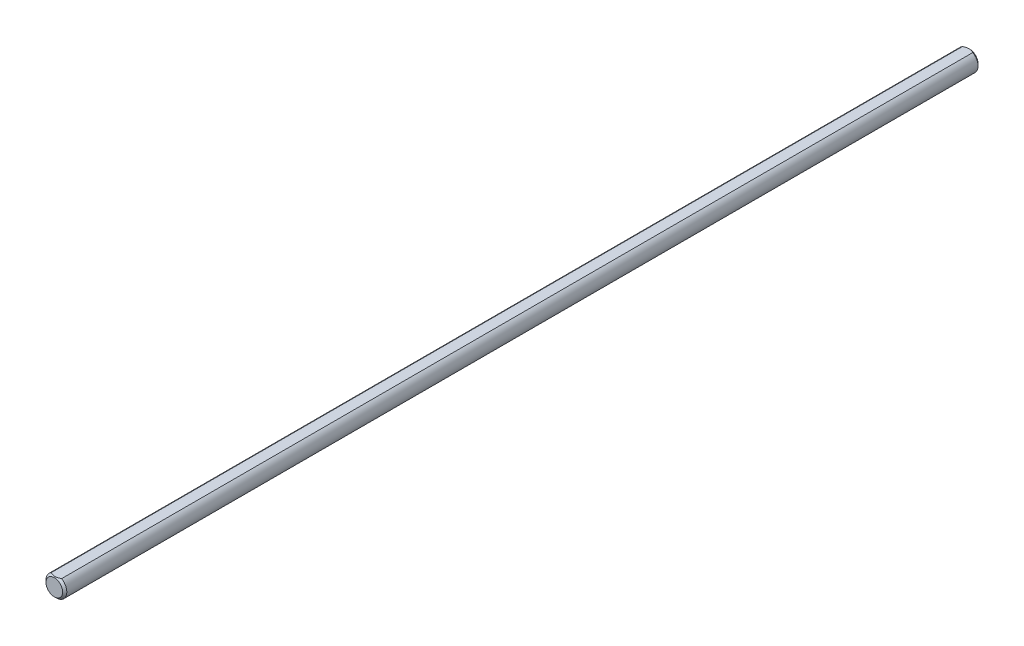
ISO-10303-21;
HEADER;
FILE_DESCRIPTION(('STEP AP214'),'2;1');
FILE_NAME('part.step','',(''),(''),'','','');
FILE_SCHEMA(('AUTOMOTIVE_DESIGN { 1 0 10303 214 1 1 1 1 }'));
ENDSEC;
DATA;
#1=APPLICATION_CONTEXT('core data for automotive mechanical design processes');
#2=APPLICATION_PROTOCOL_DEFINITION('international standard','automotive_design',2000,#1);
#3=PRODUCT_CONTEXT('',#1,'mechanical');
#4=PRODUCT('Part','Part','',(#3));
#5=PRODUCT_RELATED_PRODUCT_CATEGORY('part','',(#4));
#6=PRODUCT_DEFINITION_FORMATION('','',#4);
#7=PRODUCT_DEFINITION_CONTEXT('part definition',#1,'design');
#8=PRODUCT_DEFINITION('design','',#6,#7);
#9=PRODUCT_DEFINITION_SHAPE('','',#8);
#10=(LENGTH_UNIT() NAMED_UNIT(*) SI_UNIT(.MILLI.,.METRE.));
#11=(NAMED_UNIT(*) PLANE_ANGLE_UNIT() SI_UNIT($,.RADIAN.));
#12=(NAMED_UNIT(*) SI_UNIT($,.STERADIAN.) SOLID_ANGLE_UNIT());
#13=UNCERTAINTY_MEASURE_WITH_UNIT(LENGTH_MEASURE(1.E-05),#10,'distance_accuracy_value','');
#14=(GEOMETRIC_REPRESENTATION_CONTEXT(3) GLOBAL_UNCERTAINTY_ASSIGNED_CONTEXT((#13)) GLOBAL_UNIT_ASSIGNED_CONTEXT((#10,
#11,#12)) REPRESENTATION_CONTEXT('',''));
#15=CARTESIAN_POINT('',(0.,0.,0.));
#16=DIRECTION('',(0.,0.,1.));
#17=DIRECTION('',(1.,0.,0.));
#18=AXIS2_PLACEMENT_3D('',#15,#16,#17);
#19=CARTESIAN_POINT('',(0.,0.,139.7));
#20=DIRECTION('',(0.,0.,-1.));
#21=DIRECTION('',(-1.,0.,0.));
#22=AXIS2_PLACEMENT_3D('',#19,#20,#21);
#23=CYLINDRICAL_SURFACE('',#22,3.175);
#24=CARTESIAN_POINT('',(0.,0.,139.065));
#25=DIRECTION('',(0.,0.,1.));
#26=DIRECTION('',(1.,0.,0.));
#27=AXIS2_PLACEMENT_3D('',#24,#25,#26);
#28=CIRCLE('',#27,3.175);
#29=CARTESIAN_POINT('',(1.5875,2.74963065701559,139.065));
#30=VERTEX_POINT('',#29);
#31=CARTESIAN_POINT('',(-1.5875,2.74963065701559,139.065));
#32=VERTEX_POINT('',#31);
#33=EDGE_CURVE('E73',#30,#32,#28,.F.);
#34=ORIENTED_EDGE('',*,*,#33,.T.);
#35=DIRECTION('',(0.,0.,1.));
#36=VECTOR('',#35,1.);
#37=CARTESIAN_POINT('',(-1.5875,2.74963065701559,-139.7));
#38=LINE('',#37,#36);
#39=CARTESIAN_POINT('',(-1.5875,2.74963065701559,-139.065));
#40=VERTEX_POINT('',#39);
#41=EDGE_CURVE('E51',#40,#32,#38,.T.);
#42=ORIENTED_EDGE('',*,*,#41,.F.);
#43=CARTESIAN_POINT('',(0.,0.,-139.065));
#44=DIRECTION('',(0.,0.,1.));
#45=DIRECTION('',(1.,0.,0.));
#46=AXIS2_PLACEMENT_3D('',#43,#44,#45);
#47=CIRCLE('',#46,3.175);
#48=CARTESIAN_POINT('',(1.5875,2.74963065701559,-139.065));
#49=VERTEX_POINT('',#48);
#50=EDGE_CURVE('E72',#40,#49,#47,.T.);
#51=ORIENTED_EDGE('',*,*,#50,.T.);
#52=DIRECTION('',(0.,0.,1.));
#53=VECTOR('',#52,1.);
#54=CARTESIAN_POINT('',(1.5875,2.74963065701559,-139.7));
#55=LINE('',#54,#53);
#56=EDGE_CURVE('E61',#49,#30,#55,.T.);
#57=ORIENTED_EDGE('',*,*,#56,.T.);
#58=EDGE_LOOP('',(#34,#42,#51,#57));
#59=FACE_BOUND('',#58,.T.);
#60=ADVANCED_FACE('F32',(#59),#23,.T.);
#61=CARTESIAN_POINT('',(0.,0.,139.7));
#62=DIRECTION('',(0.,0.,1.));
#63=DIRECTION('',(1.,0.,0.));
#64=AXIS2_PLACEMENT_3D('',#61,#62,#63);
#65=PLANE('',#64);
#66=CARTESIAN_POINT('',(0.,0.,139.7));
#67=DIRECTION('',(0.,0.,1.));
#68=DIRECTION('',(1.,0.,0.));
#69=AXIS2_PLACEMENT_3D('',#66,#67,#68);
#70=CIRCLE('',#69,2.53999999999996);
#71=CARTESIAN_POINT('',(2.53999999999996,0.,139.7));
#72=VERTEX_POINT('',#71);
#73=EDGE_CURVE('E45',#72,#72,#70,.T.);
#74=ORIENTED_EDGE('',*,*,#73,.T.);
#75=EDGE_LOOP('',(#74));
#76=FACE_BOUND('',#75,.T.);
#77=ADVANCED_FACE('F83',(#76),#65,.T.);
#78=CARTESIAN_POINT('',(0.,0.,-139.7));
#79=DIRECTION('',(0.,0.,1.));
#80=DIRECTION('',(1.,0.,0.));
#81=AXIS2_PLACEMENT_3D('',#78,#79,#80);
#82=PLANE('',#81);
#83=CARTESIAN_POINT('',(0.,0.,-139.7));
#84=DIRECTION('',(0.,0.,1.));
#85=DIRECTION('',(1.,0.,0.));
#86=AXIS2_PLACEMENT_3D('',#83,#84,#85);
#87=CIRCLE('',#86,2.53999999999993);
#88=CARTESIAN_POINT('',(2.53999999999993,0.,-139.7));
#89=VERTEX_POINT('',#88);
#90=EDGE_CURVE('E75',#89,#89,#87,.F.);
#91=ORIENTED_EDGE('',*,*,#90,.T.);
#92=EDGE_LOOP('',(#91));
#93=FACE_BOUND('',#92,.T.);
#94=ADVANCED_FACE('F91',(#93),#82,.F.);
#95=CARTESIAN_POINT('',(0.,0.,-139.065));
#96=DIRECTION('',(0.,0.,1.));
#97=DIRECTION('',(1.,0.,0.));
#98=AXIS2_PLACEMENT_3D('',#95,#96,#97);
#99=CONICAL_SURFACE('',#98,3.175,0.785398163397462);
#100=CARTESIAN_POINT('',(-3.22896135223731,2.74963065701559,-137.998931718984));
#101=CARTESIAN_POINT('',(-3.15061649550106,2.74963065701559,-138.058566524546));
#102=CARTESIAN_POINT('',(-3.07184009651265,2.74963065701559,-138.117643482025));
#103=CARTESIAN_POINT('',(-2.91325130568821,2.74963065701559,-138.234429717618));
#104=CARTESIAN_POINT('',(-2.83343866506297,2.74963065701559,-138.292138657526));
#105=CARTESIAN_POINT('',(-2.67202062852748,2.74963065701559,-138.406347547805));
#106=CARTESIAN_POINT('',(-2.5904061397043,2.74963065701559,-138.462834689537));
#107=CARTESIAN_POINT('',(-2.42580311622165,2.74963065701559,-138.573763514334));
#108=CARTESIAN_POINT('',(-2.34281467809336,2.74963065701559,-138.628205340228));
#109=CARTESIAN_POINT('',(-2.17021447787229,2.74963065701559,-138.737773871166));
#110=CARTESIAN_POINT('',(-2.08050398524193,2.74963065701559,-138.79274583534));
#111=CARTESIAN_POINT('',(-1.89900904678691,2.74963065701559,-138.899146993198));
#112=CARTESIAN_POINT('',(-1.80722487525635,2.74963065701559,-138.950576651835));
#113=CARTESIAN_POINT('',(-1.6215376036893,2.74963065701559,-139.048814805051));
#114=CARTESIAN_POINT('',(-1.52764140922494,2.74963065701559,-139.095636250177));
#115=CARTESIAN_POINT('',(-1.33724706572099,2.74963065701559,-139.183600815341));
#116=CARTESIAN_POINT('',(-1.24075014112706,2.74963065701559,-139.224746553594));
#117=CARTESIAN_POINT('',(-1.05364742760746,2.74963065701559,-139.29655643723));
#118=CARTESIAN_POINT('',(-0.963276425588622,2.74963065701559,-139.327826043973));
#119=CARTESIAN_POINT('',(-0.780303735161084,2.74963065701559,-139.38312318735));
#120=CARTESIAN_POINT('',(-0.687701898779438,2.74963065701559,-139.407150242145));
#121=CARTESIAN_POINT('',(-0.502391431282823,2.74963065701559,-139.446288290841));
#122=CARTESIAN_POINT('',(-0.409716445146727,2.74963065701559,-139.461555954749));
#123=CARTESIAN_POINT('',(-0.223306330685238,2.74963065701559,-139.482868842029));
#124=CARTESIAN_POINT('',(-0.129571403437338,2.74963065701559,-139.488915786014));
#125=CARTESIAN_POINT('',(0.0543357559017082,2.74963065701559,-139.491309485248));
#126=CARTESIAN_POINT('',(0.144503242552398,2.74963065701559,-139.488028086228));
#127=CARTESIAN_POINT('',(0.324095543573444,2.74963065701559,-139.472781771964));
#128=CARTESIAN_POINT('',(0.413520286896899,2.74963065701559,-139.460816035481));
#129=CARTESIAN_POINT('',(0.592496066024105,2.74963065701559,-139.428661523536));
#130=CARTESIAN_POINT('',(0.682021177379052,2.74963065701559,-139.408330580175));
#131=CARTESIAN_POINT('',(0.859103373963862,2.74963065701559,-139.360545197954));
#132=CARTESIAN_POINT('',(0.946660601088825,2.74963065701559,-139.333091274501));
#133=CARTESIAN_POINT('',(1.21954622680469,2.74963065701559,-139.23712948219));
#134=CARTESIAN_POINT('',(1.40108594012673,2.74963065701559,-139.157809452736));
#135=CARTESIAN_POINT('',(1.66675889489869,2.74963065701559,-139.025553985226));
#136=CARTESIAN_POINT('',(1.75437488385027,2.74963065701559,-138.979152661124));
#137=CARTESIAN_POINT('',(1.92761951465612,2.74963065701559,-138.882769237768));
#138=CARTESIAN_POINT('',(2.01324850705468,2.74963065701559,-138.832787776575));
#139=CARTESIAN_POINT('',(2.1785518428575,2.74963065701559,-138.732513843306));
#140=CARTESIAN_POINT('',(2.25831097248816,2.74963065701559,-138.682359559039));
#141=CARTESIAN_POINT('',(2.41646118640013,2.74963065701559,-138.579928217762));
#142=CARTESIAN_POINT('',(2.49485216688194,2.74963065701559,-138.52765100068));
#143=CARTESIAN_POINT('',(2.64980987258646,2.74963065701559,-138.421783125055));
#144=CARTESIAN_POINT('',(2.72638621983976,2.74963065701559,-138.368206491774));
#145=CARTESIAN_POINT('',(2.87849044969186,2.74963065701559,-138.259627090017));
#146=CARTESIAN_POINT('',(2.95401861519282,2.74963065701559,-138.204624718309));
#147=CARTESIAN_POINT('',(3.02910770969644,2.74963065701559,-138.149038955582));
#148=B_SPLINE_CURVE_WITH_KNOTS('',3,(#100,#101,#102,#103,#104,#105,#106,#107,#108,#109,#110,
#111,#112,#113,#114,#115,#116,#117,#118,#119,#120,#121,#122,#123,#124,#125,#126,#127,#128,#129,
#130,#131,#132,#133,#134,#135,#136,#137,#138,#139,#140,#141,#142,#143,#144,#145,#146,#147),
.UNSPECIFIED.,.F.,.F.,(4,2,2,2,2,2,2,2,2,2,2,2,2,2,2,2,2,2,2,2,2,2,2,4),(0.,0.295383449271199,
0.590839178498771,0.888580871622947,1.18630173399069,1.50187785569756,1.81741247644347,
2.13203338294822,2.44650866534177,2.73314264689636,3.01979569373835,3.30114758261627,
3.58244696402028,3.85269226293496,4.12296312107191,4.39803055604401,4.67307809311875,
5.26557071241321,5.56297998480392,5.8603363833348,6.14295523590894,6.4255954379694,
6.70595195130136,6.98623126477286),.UNSPECIFIED.);
#149=EDGE_CURVE('E56',#49,#40,#148,.F.);
#150=ORIENTED_EDGE('',*,*,#149,.F.);
#151=ORIENTED_EDGE('',*,*,#50,.F.);
#152=EDGE_LOOP('',(#150,#151));
#153=FACE_BOUND('',#152,.T.);
#154=ORIENTED_EDGE('',*,*,#90,.F.);
#155=EDGE_LOOP('',(#154));
#156=FACE_BOUND('',#155,.T.);
#157=ADVANCED_FACE('F70',(#153,#156),#99,.T.);
#158=CARTESIAN_POINT('',(0.,0.,139.7));
#159=DIRECTION('',(0.,0.,-1.));
#160=DIRECTION('',(-1.,0.,0.));
#161=AXIS2_PLACEMENT_3D('',#158,#159,#160);
#162=CONICAL_SURFACE('',#161,2.53999999999996,0.78539816339744);
#163=CARTESIAN_POINT('',(-3.22896135223726,2.74963065701559,137.998931718984));
#164=CARTESIAN_POINT('',(-3.15061649550101,2.74963065701559,138.058566524546));
#165=CARTESIAN_POINT('',(-3.0718400965126,2.74963065701559,138.117643482025));
#166=CARTESIAN_POINT('',(-2.91325130568815,2.74963065701559,138.234429717618));
#167=CARTESIAN_POINT('',(-2.83343866506291,2.74963065701559,138.292138657526));
#168=CARTESIAN_POINT('',(-2.67202062852743,2.74963065701559,138.406347547805));
#169=CARTESIAN_POINT('',(-2.59040613970425,2.74963065701559,138.462834689537));
#170=CARTESIAN_POINT('',(-2.42580311622161,2.74963065701559,138.573763514334));
#171=CARTESIAN_POINT('',(-2.34281467809333,2.74963065701559,138.628205340228));
#172=CARTESIAN_POINT('',(-2.17021447787227,2.74963065701559,138.737773871166));
#173=CARTESIAN_POINT('',(-2.08050398524191,2.74963065701559,138.79274583534));
#174=CARTESIAN_POINT('',(-1.8990090467869,2.74963065701559,138.899146993198));
#175=CARTESIAN_POINT('',(-1.80722487525634,2.74963065701559,138.950576651835));
#176=CARTESIAN_POINT('',(-1.62153760368929,2.74963065701559,139.048814805051));
#177=CARTESIAN_POINT('',(-1.52764140922493,2.74963065701559,139.095636250177));
#178=CARTESIAN_POINT('',(-1.33724706572099,2.74963065701559,139.183600815341));
#179=CARTESIAN_POINT('',(-1.24075014112707,2.74963065701559,139.224746553594));
#180=CARTESIAN_POINT('',(-1.05364742760748,2.74963065701559,139.29655643723));
#181=CARTESIAN_POINT('',(-0.963276425588636,2.74963065701559,139.327826043973));
#182=CARTESIAN_POINT('',(-0.780303735161104,2.74963065701559,139.38312318735));
#183=CARTESIAN_POINT('',(-0.687701898779464,2.74963065701559,139.407150242145));
#184=CARTESIAN_POINT('',(-0.502391431282856,2.74963065701559,139.446288290841));
#185=CARTESIAN_POINT('',(-0.409716445146761,2.74963065701559,139.461555954749));
#186=CARTESIAN_POINT('',(-0.223306330685273,2.74963065701559,139.482868842029));
#187=CARTESIAN_POINT('',(-0.129571403437375,2.74963065701559,139.488915786014));
#188=CARTESIAN_POINT('',(0.0543357559016696,2.74963065701559,139.491309485248));
#189=CARTESIAN_POINT('',(0.144503242552357,2.74963065701559,139.488028086228));
#190=CARTESIAN_POINT('',(0.324095543573397,2.74963065701559,139.472781771964));
#191=CARTESIAN_POINT('',(0.413520286896848,2.74963065701559,139.460816035481));
#192=CARTESIAN_POINT('',(0.59249606602405,2.74963065701559,139.428661523536));
#193=CARTESIAN_POINT('',(0.682021177378997,2.74963065701559,139.408330580175));
#194=CARTESIAN_POINT('',(0.859103373963801,2.74963065701559,139.360545197954));
#195=CARTESIAN_POINT('',(0.946660601088758,2.74963065701559,139.333091274501));
#196=CARTESIAN_POINT('',(1.2195462268046,2.74963065701559,139.23712948219));
#197=CARTESIAN_POINT('',(1.40108594012662,2.74963065701559,139.157809452736));
#198=CARTESIAN_POINT('',(1.66675889489855,2.74963065701559,139.025553985226));
#199=CARTESIAN_POINT('',(1.75437488385011,2.74963065701559,138.979152661124));
#200=CARTESIAN_POINT('',(1.92761951465594,2.74963065701559,138.882769237768));
#201=CARTESIAN_POINT('',(2.0132485070545,2.74963065701559,138.832787776576));
#202=CARTESIAN_POINT('',(2.1785518428573,2.74963065701559,138.732513843306));
#203=CARTESIAN_POINT('',(2.25831097248794,2.74963065701559,138.68235955904));
#204=CARTESIAN_POINT('',(2.41646118639991,2.74963065701559,138.579928217763));
#205=CARTESIAN_POINT('',(2.49485216688171,2.74963065701559,138.527651000681));
#206=CARTESIAN_POINT('',(2.64980987258622,2.74963065701559,138.421783125055));
#207=CARTESIAN_POINT('',(2.72638621983951,2.74963065701559,138.368206491774));
#208=CARTESIAN_POINT('',(2.87849044969159,2.74963065701559,138.259627090017));
#209=CARTESIAN_POINT('',(2.95401861519254,2.74963065701559,138.204624718309));
#210=CARTESIAN_POINT('',(3.02910770969616,2.74963065701559,138.149038955583));
#211=B_SPLINE_CURVE_WITH_KNOTS('',3,(#163,#164,#165,#166,#167,#168,#169,#170,#171,#172,#173,
#174,#175,#176,#177,#178,#179,#180,#181,#182,#183,#184,#185,#186,#187,#188,#189,#190,#191,#192,
#193,#194,#195,#196,#197,#198,#199,#200,#201,#202,#203,#204,#205,#206,#207,#208,#209,#210),
.UNSPECIFIED.,.F.,.F.,(4,2,2,2,2,2,2,2,2,2,2,2,2,2,2,2,2,2,2,2,2,2,2,4),(0.,0.295383449271221,
0.590839178498797,0.888580871622942,1.18630173399069,1.50187785569754,1.81741247644344,
2.13203338294819,2.44650866534172,2.73314264689631,3.01979569373829,3.3011475826162,
3.58244696402021,3.85269226293488,4.12296312107182,4.39803055604392,4.67307809311865,
5.26557071241303,5.56297998480369,5.86033638333455,6.14295523590866,6.42559543796911,
6.70595195130103,6.9862312647725),.UNSPECIFIED.);
#212=EDGE_CURVE('E11',#32,#30,#211,.T.);
#213=ORIENTED_EDGE('',*,*,#212,.F.);
#214=ORIENTED_EDGE('',*,*,#33,.F.);
#215=EDGE_LOOP('',(#213,#214));
#216=FACE_BOUND('',#215,.T.);
#217=ORIENTED_EDGE('',*,*,#73,.F.);
#218=EDGE_LOOP('',(#217));
#219=FACE_BOUND('',#218,.T.);
#220=ADVANCED_FACE('F34',(#216,#219),#162,.T.);
#221=CARTESIAN_POINT('',(-1.5875,2.74963065701559,-139.7));
#222=DIRECTION('',(0.,-1.,0.));
#223=DIRECTION('',(0.,0.,-1.));
#224=AXIS2_PLACEMENT_3D('',#221,#222,#223);
#225=PLANE('',#224);
#226=ORIENTED_EDGE('',*,*,#149,.T.);
#227=ORIENTED_EDGE('',*,*,#41,.T.);
#228=ORIENTED_EDGE('',*,*,#212,.T.);
#229=ORIENTED_EDGE('',*,*,#56,.F.);
#230=EDGE_LOOP('',(#226,#227,#228,#229));
#231=FACE_BOUND('',#230,.T.);
#232=ADVANCED_FACE('F62',(#231),#225,.F.);
#233=CLOSED_SHELL('',(#60,#77,#94,#157,#220,#232));
#234=MANIFOLD_SOLID_BREP('B2',#233);
#235=ADVANCED_BREP_SHAPE_REPRESENTATION('',(#18,#234),#14);
#236=SHAPE_DEFINITION_REPRESENTATION(#9,#235);
ENDSEC;
END-ISO-10303-21;
